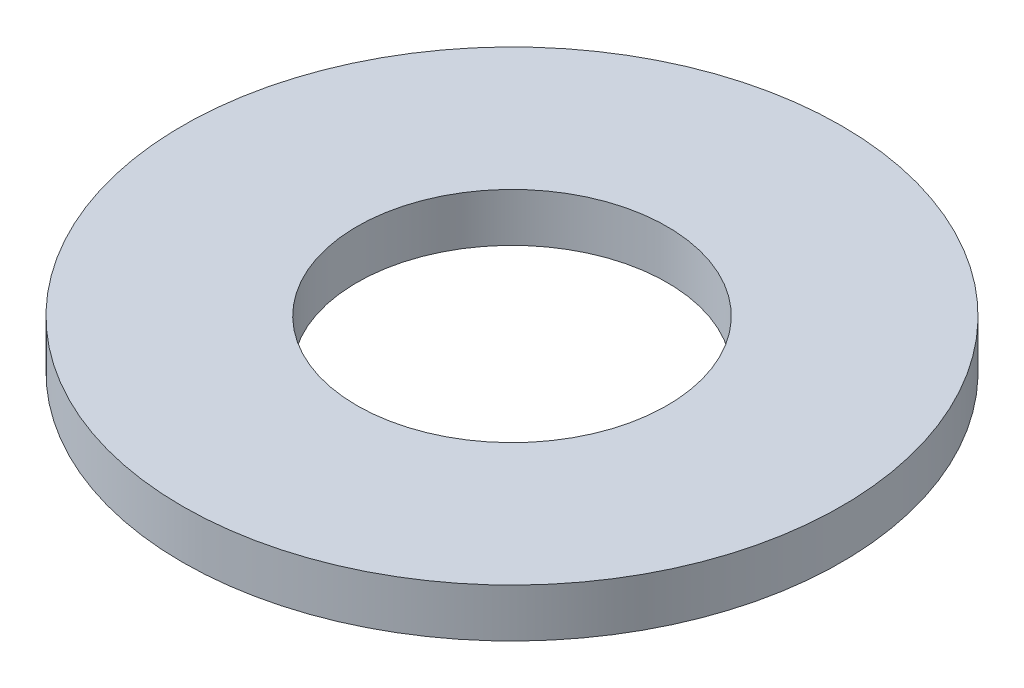
ISO-10303-21;
HEADER;
FILE_DESCRIPTION(('STEP AP214'),'2;1');
FILE_NAME('part.step','',(''),(''),'','','');
FILE_SCHEMA(('AUTOMOTIVE_DESIGN { 1 0 10303 214 1 1 1 1 }'));
ENDSEC;
DATA;
#1=APPLICATION_CONTEXT('core data for automotive mechanical design processes');
#2=APPLICATION_PROTOCOL_DEFINITION('international standard','automotive_design',2000,#1);
#3=PRODUCT_CONTEXT('',#1,'mechanical');
#4=PRODUCT('Part','Part','',(#3));
#5=PRODUCT_RELATED_PRODUCT_CATEGORY('part','',(#4));
#6=PRODUCT_DEFINITION_FORMATION('','',#4);
#7=PRODUCT_DEFINITION_CONTEXT('part definition',#1,'design');
#8=PRODUCT_DEFINITION('design','',#6,#7);
#9=PRODUCT_DEFINITION_SHAPE('','',#8);
#10=(LENGTH_UNIT() NAMED_UNIT(*) SI_UNIT(.MILLI.,.METRE.));
#11=(NAMED_UNIT(*) PLANE_ANGLE_UNIT() SI_UNIT($,.RADIAN.));
#12=(NAMED_UNIT(*) SI_UNIT($,.STERADIAN.) SOLID_ANGLE_UNIT());
#13=UNCERTAINTY_MEASURE_WITH_UNIT(LENGTH_MEASURE(1.E-05),#10,'distance_accuracy_value','');
#14=(GEOMETRIC_REPRESENTATION_CONTEXT(3) GLOBAL_UNCERTAINTY_ASSIGNED_CONTEXT((#13)) GLOBAL_UNIT_ASSIGNED_CONTEXT((#10,
#11,#12)) REPRESENTATION_CONTEXT('',''));
#15=CARTESIAN_POINT('',(0.,0.,0.));
#16=DIRECTION('',(0.,0.,1.));
#17=DIRECTION('',(1.,0.,0.));
#18=AXIS2_PLACEMENT_3D('',#15,#16,#17);
#19=CARTESIAN_POINT('',(0.,0.5,0.));
#20=DIRECTION('',(0.,1.,0.));
#21=DIRECTION('',(0.,0.,1.));
#22=AXIS2_PLACEMENT_3D('',#19,#20,#21);
#23=PLANE('',#22);
#24=CARTESIAN_POINT('',(0.,0.5,0.));
#25=DIRECTION('',(0.,1.,0.));
#26=DIRECTION('',(0.,0.,1.));
#27=AXIS2_PLACEMENT_3D('',#24,#25,#26);
#28=CIRCLE('',#27,3.4);
#29=CARTESIAN_POINT('',(0.,0.5,3.4));
#30=VERTEX_POINT('',#29);
#31=EDGE_CURVE('E10',#30,#30,#28,.T.);
#32=ORIENTED_EDGE('',*,*,#31,.T.);
#33=EDGE_LOOP('',(#32));
#34=FACE_BOUND('',#33,.T.);
#35=CARTESIAN_POINT('',(0.,0.5,0.));
#36=DIRECTION('',(0.,1.,0.));
#37=DIRECTION('',(0.,0.,1.));
#38=AXIS2_PLACEMENT_3D('',#35,#36,#37);
#39=CIRCLE('',#38,1.6);
#40=CARTESIAN_POINT('',(0.,0.5,1.6));
#41=VERTEX_POINT('',#40);
#42=EDGE_CURVE('E39',#41,#41,#39,.T.);
#43=ORIENTED_EDGE('',*,*,#42,.F.);
#44=EDGE_LOOP('',(#43));
#45=FACE_BOUND('',#44,.T.);
#46=ADVANCED_FACE('F28',(#34,#45),#23,.T.);
#47=CARTESIAN_POINT('',(0.,0.,0.));
#48=DIRECTION('',(0.,1.,0.));
#49=DIRECTION('',(0.,0.,1.));
#50=AXIS2_PLACEMENT_3D('',#47,#48,#49);
#51=PLANE('',#50);
#52=CARTESIAN_POINT('',(0.,0.,0.));
#53=DIRECTION('',(0.,1.,0.));
#54=DIRECTION('',(0.,0.,1.));
#55=AXIS2_PLACEMENT_3D('',#52,#53,#54);
#56=CIRCLE('',#55,3.4);
#57=CARTESIAN_POINT('',(0.,0.,3.4));
#58=VERTEX_POINT('',#57);
#59=EDGE_CURVE('E35',#58,#58,#56,.T.);
#60=ORIENTED_EDGE('',*,*,#59,.F.);
#61=EDGE_LOOP('',(#60));
#62=FACE_BOUND('',#61,.T.);
#63=CARTESIAN_POINT('',(0.,0.,0.));
#64=DIRECTION('',(0.,1.,0.));
#65=DIRECTION('',(0.,0.,1.));
#66=AXIS2_PLACEMENT_3D('',#63,#64,#65);
#67=CIRCLE('',#66,1.6);
#68=CARTESIAN_POINT('',(0.,0.,1.6));
#69=VERTEX_POINT('',#68);
#70=EDGE_CURVE('E43',#69,#69,#67,.T.);
#71=ORIENTED_EDGE('',*,*,#70,.T.);
#72=EDGE_LOOP('',(#71));
#73=FACE_BOUND('',#72,.T.);
#74=ADVANCED_FACE('F49',(#62,#73),#51,.F.);
#75=CARTESIAN_POINT('',(0.,0.5,0.));
#76=DIRECTION('',(0.,-1.,0.));
#77=DIRECTION('',(0.,0.,-1.));
#78=AXIS2_PLACEMENT_3D('',#75,#76,#77);
#79=CYLINDRICAL_SURFACE('',#78,3.4);
#80=ORIENTED_EDGE('',*,*,#31,.F.);
#81=EDGE_LOOP('',(#80));
#82=FACE_BOUND('',#81,.T.);
#83=ORIENTED_EDGE('',*,*,#59,.T.);
#84=EDGE_LOOP('',(#83));
#85=FACE_BOUND('',#84,.T.);
#86=ADVANCED_FACE('F30',(#82,#85),#79,.T.);
#87=CARTESIAN_POINT('',(0.,0.5,0.));
#88=DIRECTION('',(0.,-1.,0.));
#89=DIRECTION('',(0.,0.,-1.));
#90=AXIS2_PLACEMENT_3D('',#87,#88,#89);
#91=CYLINDRICAL_SURFACE('',#90,1.6);
#92=ORIENTED_EDGE('',*,*,#42,.T.);
#93=EDGE_LOOP('',(#92));
#94=FACE_BOUND('',#93,.T.);
#95=ORIENTED_EDGE('',*,*,#70,.F.);
#96=EDGE_LOOP('',(#95));
#97=FACE_BOUND('',#96,.T.);
#98=ADVANCED_FACE('F51',(#94,#97),#91,.F.);
#99=CLOSED_SHELL('',(#46,#74,#86,#98));
#100=MANIFOLD_SOLID_BREP('B2',#99);
#101=ADVANCED_BREP_SHAPE_REPRESENTATION('',(#18,#100),#14);
#102=SHAPE_DEFINITION_REPRESENTATION(#9,#101);
ENDSEC;
END-ISO-10303-21;
